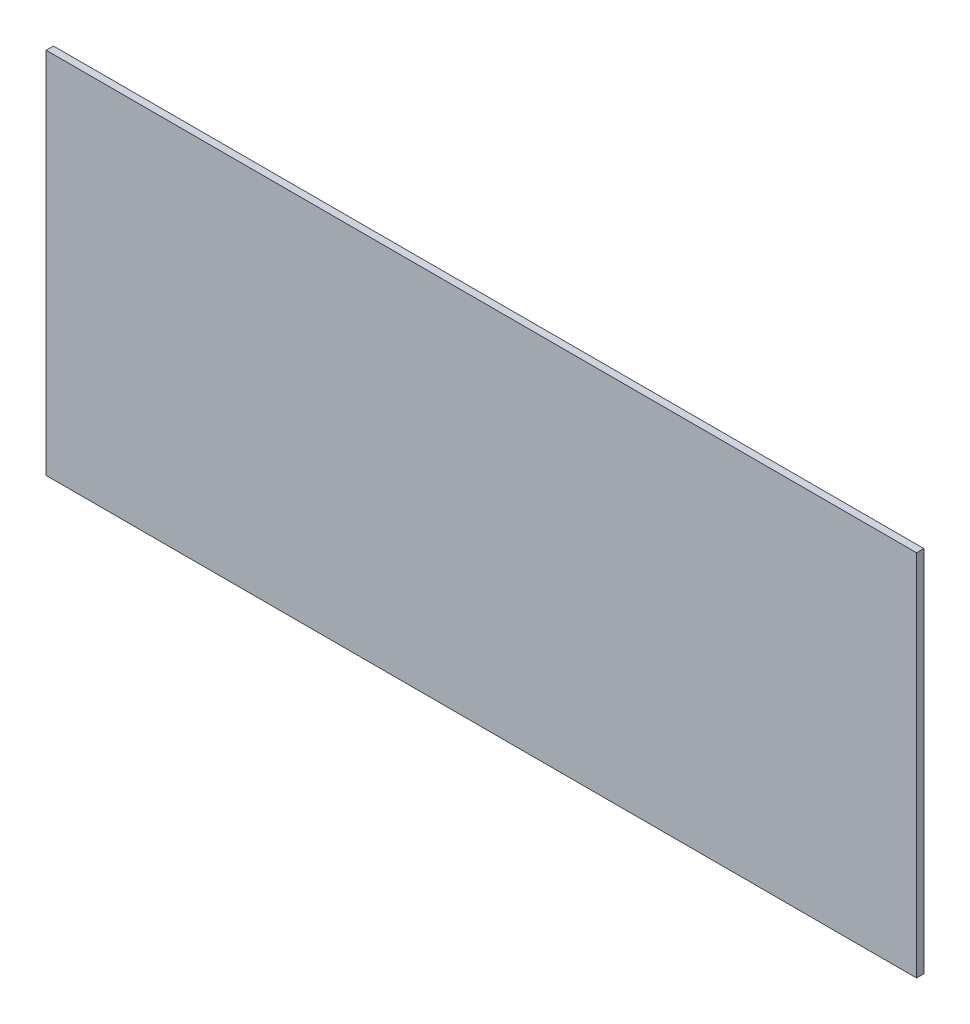
ISO-10303-21;
HEADER;
FILE_DESCRIPTION(('STEP AP214'),'2;1');
FILE_NAME('part.step','',(''),(''),'','','');
FILE_SCHEMA(('AUTOMOTIVE_DESIGN { 1 0 10303 214 1 1 1 1 }'));
ENDSEC;
DATA;
#1=APPLICATION_CONTEXT('core data for automotive mechanical design processes');
#2=APPLICATION_PROTOCOL_DEFINITION('international standard','automotive_design',2000,#1);
#3=PRODUCT_CONTEXT('',#1,'mechanical');
#4=PRODUCT('Part','Part','',(#3));
#5=PRODUCT_RELATED_PRODUCT_CATEGORY('part','',(#4));
#6=PRODUCT_DEFINITION_FORMATION('','',#4);
#7=PRODUCT_DEFINITION_CONTEXT('part definition',#1,'design');
#8=PRODUCT_DEFINITION('design','',#6,#7);
#9=PRODUCT_DEFINITION_SHAPE('','',#8);
#10=(LENGTH_UNIT() NAMED_UNIT(*) SI_UNIT(.MILLI.,.METRE.));
#11=(NAMED_UNIT(*) PLANE_ANGLE_UNIT() SI_UNIT($,.RADIAN.));
#12=(NAMED_UNIT(*) SI_UNIT($,.STERADIAN.) SOLID_ANGLE_UNIT());
#13=UNCERTAINTY_MEASURE_WITH_UNIT(LENGTH_MEASURE(1.E-05),#10,'distance_accuracy_value','');
#14=(GEOMETRIC_REPRESENTATION_CONTEXT(3) GLOBAL_UNCERTAINTY_ASSIGNED_CONTEXT((#13)) GLOBAL_UNIT_ASSIGNED_CONTEXT((#10,
#11,#12)) REPRESENTATION_CONTEXT('',''));
#15=CARTESIAN_POINT('',(0.,0.,0.));
#16=DIRECTION('',(0.,0.,1.));
#17=DIRECTION('',(1.,0.,0.));
#18=AXIS2_PLACEMENT_3D('',#15,#16,#17);
#19=CARTESIAN_POINT('',(268.25,-113.5,2.2479));
#20=DIRECTION('',(-1.,0.,0.));
#21=DIRECTION('',(0.,0.,1.));
#22=AXIS2_PLACEMENT_3D('',#19,#20,#21);
#23=PLANE('',#22);
#24=DIRECTION('',(0.,1.,0.));
#25=VECTOR('',#24,1.);
#26=CARTESIAN_POINT('',(268.25,-113.5,-2.2479));
#27=LINE('',#26,#25);
#28=CARTESIAN_POINT('',(268.25,-113.5,-2.2479));
#29=VERTEX_POINT('',#28);
#30=CARTESIAN_POINT('',(268.25,113.5,-2.2479));
#31=VERTEX_POINT('',#30);
#32=EDGE_CURVE('E96',#29,#31,#27,.T.);
#33=ORIENTED_EDGE('',*,*,#32,.T.);
#34=DIRECTION('',(0.,0.,-1.));
#35=VECTOR('',#34,1.);
#36=CARTESIAN_POINT('',(268.25,113.5,2.2479));
#37=LINE('',#36,#35);
#38=CARTESIAN_POINT('',(268.25,113.5,2.2479));
#39=VERTEX_POINT('',#38);
#40=EDGE_CURVE('E11',#39,#31,#37,.T.);
#41=ORIENTED_EDGE('',*,*,#40,.F.);
#42=DIRECTION('',(0.,1.,0.));
#43=VECTOR('',#42,1.);
#44=CARTESIAN_POINT('',(268.25,-113.5,2.2479));
#45=LINE('',#44,#43);
#46=CARTESIAN_POINT('',(268.25,-113.5,2.2479));
#47=VERTEX_POINT('',#46);
#48=EDGE_CURVE('E84',#47,#39,#45,.T.);
#49=ORIENTED_EDGE('',*,*,#48,.F.);
#50=DIRECTION('',(0.,0.,-1.));
#51=VECTOR('',#50,1.);
#52=CARTESIAN_POINT('',(268.25,-113.5,2.2479));
#53=LINE('',#52,#51);
#54=EDGE_CURVE('E92',#47,#29,#53,.T.);
#55=ORIENTED_EDGE('',*,*,#54,.T.);
#56=EDGE_LOOP('',(#33,#41,#49,#55));
#57=FACE_BOUND('',#56,.T.);
#58=ADVANCED_FACE('F33',(#57),#23,.F.);
#59=CARTESIAN_POINT('',(-268.25,113.5,2.2479));
#60=DIRECTION('',(0.,-1.,0.));
#61=DIRECTION('',(0.,0.,-1.));
#62=AXIS2_PLACEMENT_3D('',#59,#60,#61);
#63=PLANE('',#62);
#64=DIRECTION('',(-1.,0.,0.));
#65=VECTOR('',#64,1.);
#66=CARTESIAN_POINT('',(-268.25,113.5,-2.2479));
#67=LINE('',#66,#65);
#68=CARTESIAN_POINT('',(-268.25,113.5,-2.2479));
#69=VERTEX_POINT('',#68);
#70=EDGE_CURVE('E88',#31,#69,#67,.T.);
#71=ORIENTED_EDGE('',*,*,#70,.T.);
#72=DIRECTION('',(0.,0.,-1.));
#73=VECTOR('',#72,1.);
#74=CARTESIAN_POINT('',(-268.25,113.5,2.2479));
#75=LINE('',#74,#73);
#76=CARTESIAN_POINT('',(-268.25,113.5,2.2479));
#77=VERTEX_POINT('',#76);
#78=EDGE_CURVE('E41',#77,#69,#75,.T.);
#79=ORIENTED_EDGE('',*,*,#78,.F.);
#80=DIRECTION('',(-1.,0.,0.));
#81=VECTOR('',#80,1.);
#82=CARTESIAN_POINT('',(-268.25,113.5,2.2479));
#83=LINE('',#82,#81);
#84=EDGE_CURVE('E79',#39,#77,#83,.T.);
#85=ORIENTED_EDGE('',*,*,#84,.F.);
#86=ORIENTED_EDGE('',*,*,#40,.T.);
#87=EDGE_LOOP('',(#71,#79,#85,#86));
#88=FACE_BOUND('',#87,.T.);
#89=ADVANCED_FACE('F87',(#88),#63,.F.);
#90=CARTESIAN_POINT('',(-268.25,-113.5,2.2479));
#91=DIRECTION('',(1.,0.,0.));
#92=DIRECTION('',(0.,0.,-1.));
#93=AXIS2_PLACEMENT_3D('',#90,#91,#92);
#94=PLANE('',#93);
#95=DIRECTION('',(0.,-1.,0.));
#96=VECTOR('',#95,1.);
#97=CARTESIAN_POINT('',(-268.25,-113.5,-2.2479));
#98=LINE('',#97,#96);
#99=CARTESIAN_POINT('',(-268.25,-113.5,-2.2479));
#100=VERTEX_POINT('',#99);
#101=EDGE_CURVE('E66',#69,#100,#98,.T.);
#102=ORIENTED_EDGE('',*,*,#101,.T.);
#103=DIRECTION('',(0.,0.,-1.));
#104=VECTOR('',#103,1.);
#105=CARTESIAN_POINT('',(-268.25,-113.5,2.2479));
#106=LINE('',#105,#104);
#107=CARTESIAN_POINT('',(-268.25,-113.5,2.2479));
#108=VERTEX_POINT('',#107);
#109=EDGE_CURVE('E89',#108,#100,#106,.T.);
#110=ORIENTED_EDGE('',*,*,#109,.F.);
#111=DIRECTION('',(0.,-1.,0.));
#112=VECTOR('',#111,1.);
#113=CARTESIAN_POINT('',(-268.25,-113.5,2.2479));
#114=LINE('',#113,#112);
#115=EDGE_CURVE('E82',#77,#108,#114,.T.);
#116=ORIENTED_EDGE('',*,*,#115,.F.);
#117=ORIENTED_EDGE('',*,*,#78,.T.);
#118=EDGE_LOOP('',(#102,#110,#116,#117));
#119=FACE_BOUND('',#118,.T.);
#120=ADVANCED_FACE('F90',(#119),#94,.F.);
#121=CARTESIAN_POINT('',(-268.25,-113.5,2.2479));
#122=DIRECTION('',(0.,1.,0.));
#123=DIRECTION('',(0.,0.,1.));
#124=AXIS2_PLACEMENT_3D('',#121,#122,#123);
#125=PLANE('',#124);
#126=DIRECTION('',(1.,0.,0.));
#127=VECTOR('',#126,1.);
#128=CARTESIAN_POINT('',(-268.25,-113.5,-2.2479));
#129=LINE('',#128,#127);
#130=EDGE_CURVE('E72',#100,#29,#129,.T.);
#131=ORIENTED_EDGE('',*,*,#130,.T.);
#132=ORIENTED_EDGE('',*,*,#54,.F.);
#133=DIRECTION('',(1.,0.,0.));
#134=VECTOR('',#133,1.);
#135=CARTESIAN_POINT('',(-268.25,-113.5,2.2479));
#136=LINE('',#135,#134);
#137=EDGE_CURVE('E49',#108,#47,#136,.T.);
#138=ORIENTED_EDGE('',*,*,#137,.F.);
#139=ORIENTED_EDGE('',*,*,#109,.T.);
#140=EDGE_LOOP('',(#131,#132,#138,#139));
#141=FACE_BOUND('',#140,.T.);
#142=ADVANCED_FACE('F103',(#141),#125,.F.);
#143=CARTESIAN_POINT('',(0.,0.,2.2479));
#144=DIRECTION('',(0.,0.,-1.));
#145=DIRECTION('',(-1.,0.,0.));
#146=AXIS2_PLACEMENT_3D('',#143,#144,#145);
#147=PLANE('',#146);
#148=ORIENTED_EDGE('',*,*,#48,.T.);
#149=ORIENTED_EDGE('',*,*,#84,.T.);
#150=ORIENTED_EDGE('',*,*,#115,.T.);
#151=ORIENTED_EDGE('',*,*,#137,.T.);
#152=EDGE_LOOP('',(#148,#149,#150,#151));
#153=FACE_BOUND('',#152,.T.);
#154=ADVANCED_FACE('F80',(#153),#147,.F.);
#155=CARTESIAN_POINT('',(0.,0.,-2.2479));
#156=DIRECTION('',(0.,0.,-1.));
#157=DIRECTION('',(-1.,0.,0.));
#158=AXIS2_PLACEMENT_3D('',#155,#156,#157);
#159=PLANE('',#158);
#160=ORIENTED_EDGE('',*,*,#32,.F.);
#161=ORIENTED_EDGE('',*,*,#130,.F.);
#162=ORIENTED_EDGE('',*,*,#101,.F.);
#163=ORIENTED_EDGE('',*,*,#70,.F.);
#164=EDGE_LOOP('',(#160,#161,#162,#163));
#165=FACE_BOUND('',#164,.T.);
#166=ADVANCED_FACE('F106',(#165),#159,.T.);
#167=CLOSED_SHELL('',(#58,#89,#120,#142,#154,#166));
#168=MANIFOLD_SOLID_BREP('B2',#167);
#169=ADVANCED_BREP_SHAPE_REPRESENTATION('',(#18,#168),#14);
#170=SHAPE_DEFINITION_REPRESENTATION(#9,#169);
ENDSEC;
END-ISO-10303-21;
